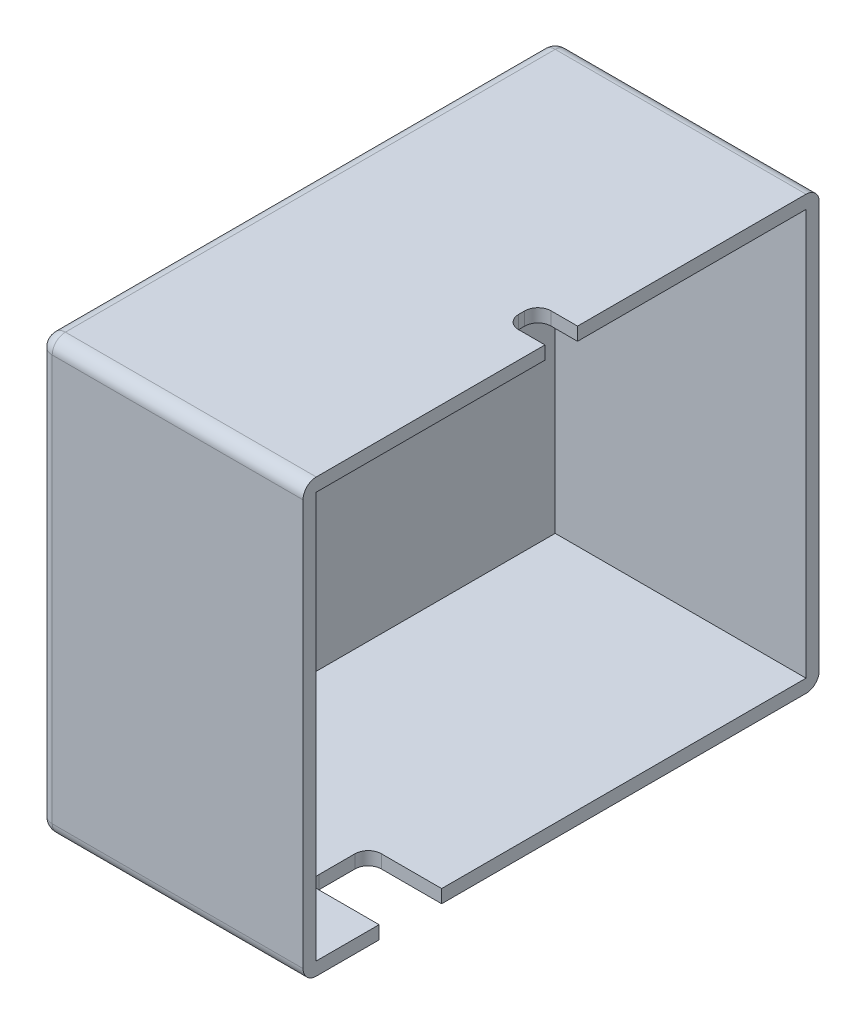
ISO-10303-21;
HEADER;
FILE_DESCRIPTION(('STEP AP214'),'2;1');
FILE_NAME('part.step','',(''),(''),'','','');
FILE_SCHEMA(('AUTOMOTIVE_DESIGN { 1 0 10303 214 1 1 1 1 }'));
ENDSEC;
DATA;
#1=APPLICATION_CONTEXT('core data for automotive mechanical design processes');
#2=APPLICATION_PROTOCOL_DEFINITION('international standard','automotive_design',2000,#1);
#3=PRODUCT_CONTEXT('',#1,'mechanical');
#4=PRODUCT('Part','Part','',(#3));
#5=PRODUCT_RELATED_PRODUCT_CATEGORY('part','',(#4));
#6=PRODUCT_DEFINITION_FORMATION('','',#4);
#7=PRODUCT_DEFINITION_CONTEXT('part definition',#1,'design');
#8=PRODUCT_DEFINITION('design','',#6,#7);
#9=PRODUCT_DEFINITION_SHAPE('','',#8);
#10=(LENGTH_UNIT() NAMED_UNIT(*) SI_UNIT(.MILLI.,.METRE.));
#11=(NAMED_UNIT(*) PLANE_ANGLE_UNIT() SI_UNIT($,.RADIAN.));
#12=(NAMED_UNIT(*) SI_UNIT($,.STERADIAN.) SOLID_ANGLE_UNIT());
#13=UNCERTAINTY_MEASURE_WITH_UNIT(LENGTH_MEASURE(1.E-05),#10,'distance_accuracy_value','');
#14=(GEOMETRIC_REPRESENTATION_CONTEXT(3) GLOBAL_UNCERTAINTY_ASSIGNED_CONTEXT((#13)) GLOBAL_UNIT_ASSIGNED_CONTEXT((#10,
#11,#12)) REPRESENTATION_CONTEXT('',''));
#15=CARTESIAN_POINT('',(0.,0.,0.));
#16=DIRECTION('',(0.,0.,1.));
#17=DIRECTION('',(1.,0.,0.));
#18=AXIS2_PLACEMENT_3D('',#15,#16,#17);
#19=CARTESIAN_POINT('',(40.,0.,0.));
#20=DIRECTION('',(1.,0.,0.));
#21=DIRECTION('',(0.,0.,-1.));
#22=AXIS2_PLACEMENT_3D('',#19,#20,#21);
#23=PLANE('',#22);
#24=DIRECTION('',(0.,1.,0.));
#25=VECTOR('',#24,1.);
#26=CARTESIAN_POINT('',(40.,14.9474180466149,-21.8083011583012));
#27=LINE('',#26,#25);
#28=CARTESIAN_POINT('',(40.,22.7162162162162,-21.8083011583012));
#29=VERTEX_POINT('',#28);
#30=CARTESIAN_POINT('',(40.,24.7162162162162,-21.8083011583012));
#31=VERTEX_POINT('',#30);
#32=EDGE_CURVE('E229',#29,#31,#27,.T.);
#33=ORIENTED_EDGE('',*,*,#32,.T.);
#34=DIRECTION('',(0.,0.,1.));
#35=VECTOR('',#34,1.);
#36=CARTESIAN_POINT('',(40.,24.7162162162162,14.8416988416988));
#37=LINE('',#36,#35);
#38=CARTESIAN_POINT('',(40.,24.7162162162162,12.8416988416988));
#39=VERTEX_POINT('',#38);
#40=EDGE_CURVE('E247',#31,#39,#37,.T.);
#41=ORIENTED_EDGE('',*,*,#40,.T.);
#42=CARTESIAN_POINT('',(40.,22.7162162162162,12.8416988416988));
#43=DIRECTION('',(1.,0.,0.));
#44=DIRECTION('',(0.,0.,-1.));
#45=AXIS2_PLACEMENT_3D('',#42,#43,#44);
#46=CIRCLE('',#45,2.);
#47=CARTESIAN_POINT('',(40.,22.7162162162162,14.8416988416988));
#48=VERTEX_POINT('',#47);
#49=EDGE_CURVE('E266',#39,#48,#46,.T.);
#50=ORIENTED_EDGE('',*,*,#49,.T.);
#51=DIRECTION('',(0.,-1.,0.));
#52=VECTOR('',#51,1.);
#53=CARTESIAN_POINT('',(40.,24.7162162162162,14.8416988416988));
#54=LINE('',#53,#52);
#55=CARTESIAN_POINT('',(40.,-38.7837837837838,14.8416988416988));
#56=VERTEX_POINT('',#55);
#57=EDGE_CURVE('E332',#48,#56,#54,.T.);
#58=ORIENTED_EDGE('',*,*,#57,.T.);
#59=CARTESIAN_POINT('',(40.,-38.7837837837838,12.8416988416988));
#60=DIRECTION('',(1.,0.,0.));
#61=DIRECTION('',(0.,0.,-1.));
#62=AXIS2_PLACEMENT_3D('',#59,#60,#61);
#63=CIRCLE('',#62,2.);
#64=CARTESIAN_POINT('',(40.,-40.7837837837838,12.8416988416988));
#65=VERTEX_POINT('',#64);
#66=EDGE_CURVE('E271',#56,#65,#63,.T.);
#67=ORIENTED_EDGE('',*,*,#66,.T.);
#68=DIRECTION('',(0.,0.,-1.));
#69=VECTOR('',#68,1.);
#70=CARTESIAN_POINT('',(40.,-40.7837837837838,14.8416988416988));
#71=LINE('',#70,#69);
#72=CARTESIAN_POINT('',(40.,-40.7837837837838,3.31669884169884));
#73=VERTEX_POINT('',#72);
#74=EDGE_CURVE('E433',#65,#73,#71,.T.);
#75=ORIENTED_EDGE('',*,*,#74,.T.);
#76=DIRECTION('',(0.,-1.,0.));
#77=VECTOR('',#76,1.);
#78=CARTESIAN_POINT('',(40.,-16.1660465497337,3.31669884169884));
#79=LINE('',#78,#77);
#80=CARTESIAN_POINT('',(40.,-38.7837837837838,3.31669884169884));
#81=VERTEX_POINT('',#80);
#82=EDGE_CURVE('E397',#81,#73,#79,.T.);
#83=ORIENTED_EDGE('',*,*,#82,.F.);
#84=DIRECTION('',(0.,0.,-1.));
#85=VECTOR('',#84,1.);
#86=CARTESIAN_POINT('',(40.,-38.7837837837838,12.8416988416988));
#87=LINE('',#86,#85);
#88=CARTESIAN_POINT('',(40.,-38.7837837837838,12.8416988416988));
#89=VERTEX_POINT('',#88);
#90=EDGE_CURVE('E411',#89,#81,#87,.T.);
#91=ORIENTED_EDGE('',*,*,#90,.F.);
#92=DIRECTION('',(0.,-1.,0.));
#93=VECTOR('',#92,1.);
#94=CARTESIAN_POINT('',(40.,-38.7837837837838,12.8416988416988));
#95=LINE('',#94,#93);
#96=CARTESIAN_POINT('',(40.,22.7162162162162,12.8416988416988));
#97=VERTEX_POINT('',#96);
#98=EDGE_CURVE('E399',#97,#89,#95,.T.);
#99=ORIENTED_EDGE('',*,*,#98,.F.);
#100=DIRECTION('',(0.,0.,1.));
#101=VECTOR('',#100,1.);
#102=CARTESIAN_POINT('',(40.,22.7162162162162,12.8416988416988));
#103=LINE('',#102,#101);
#104=EDGE_CURVE('E417',#29,#97,#103,.T.);
#105=ORIENTED_EDGE('',*,*,#104,.F.);
#106=EDGE_LOOP('',(#33,#41,#50,#58,#67,#75,#83,#91,#99,#105));
#107=FACE_BOUND('',#106,.T.);
#108=ADVANCED_FACE('F45',(#107),#23,.T.);
#109=CARTESIAN_POINT('',(40.,24.7162162162162,14.8416988416988));
#110=DIRECTION('',(0.,0.,-1.));
#111=DIRECTION('',(0.,1.,0.));
#112=AXIS2_PLACEMENT_3D('',#109,#110,#111);
#113=PLANE('',#112);
#114=DIRECTION('',(0.,-1.,0.));
#115=VECTOR('',#114,1.);
#116=CARTESIAN_POINT('',(2.,24.7162162162162,14.8416988416988));
#117=LINE('',#116,#115);
#118=CARTESIAN_POINT('',(2.,22.7162162162162,14.8416988416988));
#119=VERTEX_POINT('',#118);
#120=CARTESIAN_POINT('',(2.,-38.7837837837838,14.8416988416988));
#121=VERTEX_POINT('',#120);
#122=EDGE_CURVE('E262',#119,#121,#117,.T.);
#123=ORIENTED_EDGE('',*,*,#122,.T.);
#124=DIRECTION('',(-1.,0.,0.));
#125=VECTOR('',#124,1.);
#126=CARTESIAN_POINT('',(40.,-38.7837837837838,14.8416988416988));
#127=LINE('',#126,#125);
#128=EDGE_CURVE('E264',#121,#56,#127,.F.);
#129=ORIENTED_EDGE('',*,*,#128,.T.);
#130=ORIENTED_EDGE('',*,*,#57,.F.);
#131=DIRECTION('',(-1.,0.,0.));
#132=VECTOR('',#131,1.);
#133=CARTESIAN_POINT('',(40.,22.7162162162162,14.8416988416988));
#134=LINE('',#133,#132);
#135=EDGE_CURVE('E260',#48,#119,#134,.T.);
#136=ORIENTED_EDGE('',*,*,#135,.T.);
#137=EDGE_LOOP('',(#123,#129,#130,#136));
#138=FACE_BOUND('',#137,.T.);
#139=ADVANCED_FACE('F488',(#138),#113,.F.);
#140=CARTESIAN_POINT('',(40.,-40.7837837837838,14.8416988416988));
#141=DIRECTION('',(0.,1.,0.));
#142=DIRECTION('',(0.,0.,1.));
#143=AXIS2_PLACEMENT_3D('',#140,#141,#142);
#144=PLANE('',#143);
#145=CARTESIAN_POINT('',(40.,-40.7837837837838,-6.15830115830116));
#146=VERTEX_POINT('',#145);
#147=CARTESIAN_POINT('',(40.,-40.7837837837838,-61.3583011583012));
#148=VERTEX_POINT('',#147);
#149=EDGE_CURVE('E432',#146,#148,#71,.T.);
#150=ORIENTED_EDGE('',*,*,#149,.F.);
#151=DIRECTION('',(1.,0.,0.));
#152=VECTOR('',#151,1.);
#153=CARTESIAN_POINT('',(28.8688447659852,-40.7837837837838,-6.15830115830116));
#154=LINE('',#153,#152);
#155=CARTESIAN_POINT('',(30.8688447659852,-40.7837837837838,-6.15830115830116));
#156=VERTEX_POINT('',#155);
#157=EDGE_CURVE('E393',#156,#146,#154,.T.);
#158=ORIENTED_EDGE('',*,*,#157,.F.);
#159=CARTESIAN_POINT('',(30.8688447659852,-40.7837837837838,-4.15830115830116));
#160=DIRECTION('',(0.,1.,0.));
#161=DIRECTION('',(0.,0.,1.));
#162=AXIS2_PLACEMENT_3D('',#159,#160,#161);
#163=CIRCLE('',#162,2.);
#164=CARTESIAN_POINT('',(28.8688447659852,-40.7837837837838,-4.15830115830116));
#165=VERTEX_POINT('',#164);
#166=EDGE_CURVE('E350',#156,#165,#163,.T.);
#167=ORIENTED_EDGE('',*,*,#166,.T.);
#168=DIRECTION('',(0.,0.,-1.));
#169=VECTOR('',#168,1.);
#170=CARTESIAN_POINT('',(28.8688447659852,-40.7837837837838,3.31669884169884));
#171=LINE('',#170,#169);
#172=CARTESIAN_POINT('',(28.8688447659852,-40.7837837837838,1.31669884169884));
#173=VERTEX_POINT('',#172);
#174=EDGE_CURVE('E383',#173,#165,#171,.T.);
#175=ORIENTED_EDGE('',*,*,#174,.F.);
#176=CARTESIAN_POINT('',(30.8688447659852,-40.7837837837838,1.31669884169884));
#177=DIRECTION('',(0.,1.,0.));
#178=DIRECTION('',(0.,0.,1.));
#179=AXIS2_PLACEMENT_3D('',#176,#177,#178);
#180=CIRCLE('',#179,2.);
#181=CARTESIAN_POINT('',(30.8688447659852,-40.7837837837838,3.31669884169884));
#182=VERTEX_POINT('',#181);
#183=EDGE_CURVE('E354',#173,#182,#180,.T.);
#184=ORIENTED_EDGE('',*,*,#183,.T.);
#185=DIRECTION('',(-1.,0.,0.));
#186=VECTOR('',#185,1.);
#187=CARTESIAN_POINT('',(28.8688447659852,-40.7837837837838,3.31669884169884));
#188=LINE('',#187,#186);
#189=EDGE_CURVE('E389',#73,#182,#188,.T.);
#190=ORIENTED_EDGE('',*,*,#189,.F.);
#191=ORIENTED_EDGE('',*,*,#74,.F.);
#192=DIRECTION('',(-1.,0.,0.));
#193=VECTOR('',#192,1.);
#194=CARTESIAN_POINT('',(40.,-40.7837837837838,12.8416988416988));
#195=LINE('',#194,#193);
#196=CARTESIAN_POINT('',(2.,-40.7837837837838,12.8416988416988));
#197=VERTEX_POINT('',#196);
#198=EDGE_CURVE('E257',#65,#197,#195,.T.);
#199=ORIENTED_EDGE('',*,*,#198,.T.);
#200=DIRECTION('',(0.,0.,-1.));
#201=VECTOR('',#200,1.);
#202=CARTESIAN_POINT('',(2.,-40.7837837837838,14.8416988416988));
#203=LINE('',#202,#201);
#204=CARTESIAN_POINT('',(2.,-40.7837837837838,-61.3583011583012));
#205=VERTEX_POINT('',#204);
#206=EDGE_CURVE('E246',#197,#205,#203,.T.);
#207=ORIENTED_EDGE('',*,*,#206,.T.);
#208=DIRECTION('',(-1.,0.,0.));
#209=VECTOR('',#208,1.);
#210=CARTESIAN_POINT('',(40.,-40.7837837837838,-61.3583011583012));
#211=LINE('',#210,#209);
#212=EDGE_CURVE('E249',#205,#148,#211,.F.);
#213=ORIENTED_EDGE('',*,*,#212,.T.);
#214=EDGE_LOOP('',(#150,#158,#167,#175,#184,#190,#191,#199,#207,#213));
#215=FACE_BOUND('',#214,.T.);
#216=ADVANCED_FACE('F446',(#215),#144,.F.);
#217=CARTESIAN_POINT('',(40.,24.7162162162162,-63.3583011583012));
#218=DIRECTION('',(0.,0.,1.));
#219=DIRECTION('',(0.,-1.,0.));
#220=AXIS2_PLACEMENT_3D('',#217,#218,#219);
#221=PLANE('',#220);
#222=DIRECTION('',(0.,1.,0.));
#223=VECTOR('',#222,1.);
#224=CARTESIAN_POINT('',(40.,24.7162162162162,-63.3583011583012));
#225=LINE('',#224,#223);
#226=CARTESIAN_POINT('',(40.,-38.7837837837838,-63.3583011583012));
#227=VERTEX_POINT('',#226);
#228=CARTESIAN_POINT('',(40.,22.7162162162162,-63.3583011583012));
#229=VERTEX_POINT('',#228);
#230=EDGE_CURVE('E251',#227,#229,#225,.T.);
#231=ORIENTED_EDGE('',*,*,#230,.F.);
#232=DIRECTION('',(-1.,0.,0.));
#233=VECTOR('',#232,1.);
#234=CARTESIAN_POINT('',(40.,-38.7837837837838,-63.3583011583012));
#235=LINE('',#234,#233);
#236=CARTESIAN_POINT('',(2.,-38.7837837837838,-63.3583011583012));
#237=VERTEX_POINT('',#236);
#238=EDGE_CURVE('E277',#227,#237,#235,.T.);
#239=ORIENTED_EDGE('',*,*,#238,.T.);
#240=DIRECTION('',(0.,1.,0.));
#241=VECTOR('',#240,1.);
#242=CARTESIAN_POINT('',(2.,24.7162162162162,-63.3583011583012));
#243=LINE('',#242,#241);
#244=CARTESIAN_POINT('',(2.,22.7162162162162,-63.3583011583012));
#245=VERTEX_POINT('',#244);
#246=EDGE_CURVE('E273',#237,#245,#243,.T.);
#247=ORIENTED_EDGE('',*,*,#246,.T.);
#248=DIRECTION('',(-1.,0.,0.));
#249=VECTOR('',#248,1.);
#250=CARTESIAN_POINT('',(40.,22.7162162162162,-63.3583011583012));
#251=LINE('',#250,#249);
#252=EDGE_CURVE('E275',#245,#229,#251,.F.);
#253=ORIENTED_EDGE('',*,*,#252,.T.);
#254=EDGE_LOOP('',(#231,#239,#247,#253));
#255=FACE_BOUND('',#254,.T.);
#256=ADVANCED_FACE('F454',(#255),#221,.F.);
#257=CARTESIAN_POINT('',(40.,24.7162162162162,14.8416988416988));
#258=DIRECTION('',(0.,-1.,0.));
#259=DIRECTION('',(0.,0.,-1.));
#260=AXIS2_PLACEMENT_3D('',#257,#258,#259);
#261=PLANE('',#260);
#262=ORIENTED_EDGE('',*,*,#40,.F.);
#263=DIRECTION('',(1.,0.,0.));
#264=VECTOR('',#263,1.);
#265=CARTESIAN_POINT('',(40.,24.7162162162162,-21.8083011583012));
#266=LINE('',#265,#264);
#267=CARTESIAN_POINT('',(36.,24.7162162162162,-21.8083011583012));
#268=VERTEX_POINT('',#267);
#269=EDGE_CURVE('E230',#268,#31,#266,.T.);
#270=ORIENTED_EDGE('',*,*,#269,.F.);
#271=CARTESIAN_POINT('',(36.,24.7162162162162,-23.8083011583012));
#272=DIRECTION('',(0.,-1.,0.));
#273=DIRECTION('',(0.,0.,-1.));
#274=AXIS2_PLACEMENT_3D('',#271,#272,#273);
#275=CIRCLE('',#274,2.);
#276=CARTESIAN_POINT('',(34.,24.7162162162162,-23.8083011583012));
#277=VERTEX_POINT('',#276);
#278=EDGE_CURVE('E53',#268,#277,#275,.T.);
#279=ORIENTED_EDGE('',*,*,#278,.T.);
#280=DIRECTION('',(0.,0.,1.));
#281=VECTOR('',#280,1.);
#282=CARTESIAN_POINT('',(34.,24.7162162162162,-26.7433011583012));
#283=LINE('',#282,#281);
#284=CARTESIAN_POINT('',(34.,24.7162162162162,-24.7433011583012));
#285=VERTEX_POINT('',#284);
#286=EDGE_CURVE('E240',#285,#277,#283,.T.);
#287=ORIENTED_EDGE('',*,*,#286,.F.);
#288=CARTESIAN_POINT('',(36.,24.7162162162162,-24.7433011583012));
#289=DIRECTION('',(0.,-1.,0.));
#290=DIRECTION('',(0.,0.,-1.));
#291=AXIS2_PLACEMENT_3D('',#288,#289,#290);
#292=CIRCLE('',#291,2.);
#293=CARTESIAN_POINT('',(36.,24.7162162162162,-26.7433011583012));
#294=VERTEX_POINT('',#293);
#295=EDGE_CURVE('E239',#285,#294,#292,.T.);
#296=ORIENTED_EDGE('',*,*,#295,.T.);
#297=DIRECTION('',(-1.,0.,0.));
#298=VECTOR('',#297,1.);
#299=CARTESIAN_POINT('',(40.,24.7162162162162,-26.7433011583012));
#300=LINE('',#299,#298);
#301=CARTESIAN_POINT('',(40.,24.7162162162162,-26.7433011583012));
#302=VERTEX_POINT('',#301);
#303=EDGE_CURVE('E221',#302,#294,#300,.T.);
#304=ORIENTED_EDGE('',*,*,#303,.F.);
#305=CARTESIAN_POINT('',(40.,24.7162162162162,-61.3583011583012));
#306=VERTEX_POINT('',#305);
#307=EDGE_CURVE('E236',#306,#302,#37,.T.);
#308=ORIENTED_EDGE('',*,*,#307,.F.);
#309=DIRECTION('',(-1.,0.,0.));
#310=VECTOR('',#309,1.);
#311=CARTESIAN_POINT('',(40.,24.7162162162162,-61.3583011583012));
#312=LINE('',#311,#310);
#313=CARTESIAN_POINT('',(2.,24.7162162162162,-61.3583011583012));
#314=VERTEX_POINT('',#313);
#315=EDGE_CURVE('E284',#306,#314,#312,.T.);
#316=ORIENTED_EDGE('',*,*,#315,.T.);
#317=DIRECTION('',(0.,0.,1.));
#318=VECTOR('',#317,1.);
#319=CARTESIAN_POINT('',(2.,24.7162162162162,14.8416988416988));
#320=LINE('',#319,#318);
#321=CARTESIAN_POINT('',(2.,24.7162162162162,12.8416988416988));
#322=VERTEX_POINT('',#321);
#323=EDGE_CURVE('E282',#314,#322,#320,.T.);
#324=ORIENTED_EDGE('',*,*,#323,.T.);
#325=DIRECTION('',(-1.,0.,0.));
#326=VECTOR('',#325,1.);
#327=CARTESIAN_POINT('',(40.,24.7162162162162,12.8416988416988));
#328=LINE('',#327,#326);
#329=EDGE_CURVE('E279',#322,#39,#328,.F.);
#330=ORIENTED_EDGE('',*,*,#329,.T.);
#331=EDGE_LOOP('',(#262,#270,#279,#287,#296,#304,#308,#316,#324,#330));
#332=FACE_BOUND('',#331,.T.);
#333=ADVANCED_FACE('F235',(#332),#261,.F.);
#334=DIRECTION('',(0.,1.,0.));
#335=VECTOR('',#334,1.);
#336=CARTESIAN_POINT('',(40.,14.9474180466149,-26.7433011583012));
#337=LINE('',#336,#335);
#338=CARTESIAN_POINT('',(40.,22.7162162162162,-26.7433011583012));
#339=VERTEX_POINT('',#338);
#340=EDGE_CURVE('E218',#339,#302,#337,.T.);
#341=ORIENTED_EDGE('',*,*,#340,.F.);
#342=CARTESIAN_POINT('',(40.,22.7162162162162,-61.3583011583012));
#343=VERTEX_POINT('',#342);
#344=EDGE_CURVE('E418',#343,#339,#103,.T.);
#345=ORIENTED_EDGE('',*,*,#344,.F.);
#346=DIRECTION('',(0.,1.,0.));
#347=VECTOR('',#346,1.);
#348=CARTESIAN_POINT('',(40.,-38.7837837837838,-61.3583011583012));
#349=LINE('',#348,#347);
#350=CARTESIAN_POINT('',(40.,-38.7837837837838,-61.3583011583012));
#351=VERTEX_POINT('',#350);
#352=EDGE_CURVE('E414',#351,#343,#349,.T.);
#353=ORIENTED_EDGE('',*,*,#352,.F.);
#354=CARTESIAN_POINT('',(40.,-38.7837837837838,-6.15830115830116));
#355=VERTEX_POINT('',#354);
#356=EDGE_CURVE('E410',#355,#351,#87,.T.);
#357=ORIENTED_EDGE('',*,*,#356,.F.);
#358=DIRECTION('',(0.,-1.,0.));
#359=VECTOR('',#358,1.);
#360=CARTESIAN_POINT('',(40.,-16.1660465497337,-6.15830115830116));
#361=LINE('',#360,#359);
#362=EDGE_CURVE('E392',#355,#146,#361,.T.);
#363=ORIENTED_EDGE('',*,*,#362,.T.);
#364=ORIENTED_EDGE('',*,*,#149,.T.);
#365=CARTESIAN_POINT('',(40.,-38.7837837837838,-61.3583011583012));
#366=DIRECTION('',(1.,0.,0.));
#367=DIRECTION('',(0.,0.,-1.));
#368=AXIS2_PLACEMENT_3D('',#365,#366,#367);
#369=CIRCLE('',#368,2.);
#370=EDGE_CURVE('E269',#148,#227,#369,.T.);
#371=ORIENTED_EDGE('',*,*,#370,.T.);
#372=ORIENTED_EDGE('',*,*,#230,.T.);
#373=CARTESIAN_POINT('',(40.,22.7162162162162,-61.3583011583012));
#374=DIRECTION('',(1.,0.,0.));
#375=DIRECTION('',(0.,0.,-1.));
#376=AXIS2_PLACEMENT_3D('',#373,#374,#375);
#377=CIRCLE('',#376,2.);
#378=EDGE_CURVE('E245',#229,#306,#377,.T.);
#379=ORIENTED_EDGE('',*,*,#378,.T.);
#380=ORIENTED_EDGE('',*,*,#307,.T.);
#381=EDGE_LOOP('',(#341,#345,#353,#357,#363,#364,#371,#372,#379,#380));
#382=FACE_BOUND('',#381,.T.);
#383=ADVANCED_FACE('F242',(#382),#23,.T.);
#384=CARTESIAN_POINT('',(0.,0.,0.));
#385=DIRECTION('',(1.,0.,0.));
#386=DIRECTION('',(0.,0.,-1.));
#387=AXIS2_PLACEMENT_3D('',#384,#385,#386);
#388=PLANE('',#387);
#389=DIRECTION('',(0.,1.,0.));
#390=VECTOR('',#389,1.);
#391=CARTESIAN_POINT('',(0.,0.,-61.3583011583012));
#392=LINE('',#391,#390);
#393=CARTESIAN_POINT('',(0.,22.7162162162162,-61.3583011583012));
#394=VERTEX_POINT('',#393);
#395=CARTESIAN_POINT('',(0.,-38.7837837837838,-61.3583011583012));
#396=VERTEX_POINT('',#395);
#397=EDGE_CURVE('E290',#394,#396,#392,.F.);
#398=ORIENTED_EDGE('',*,*,#397,.T.);
#399=DIRECTION('',(0.,0.,-1.));
#400=VECTOR('',#399,1.);
#401=CARTESIAN_POINT('',(0.,-38.7837837837838,0.));
#402=LINE('',#401,#400);
#403=CARTESIAN_POINT('',(0.,-38.7837837837838,12.8416988416988));
#404=VERTEX_POINT('',#403);
#405=EDGE_CURVE('E293',#396,#404,#402,.F.);
#406=ORIENTED_EDGE('',*,*,#405,.T.);
#407=DIRECTION('',(0.,-1.,0.));
#408=VECTOR('',#407,1.);
#409=CARTESIAN_POINT('',(0.,0.,12.8416988416988));
#410=LINE('',#409,#408);
#411=CARTESIAN_POINT('',(0.,22.7162162162162,12.8416988416988));
#412=VERTEX_POINT('',#411);
#413=EDGE_CURVE('E288',#404,#412,#410,.F.);
#414=ORIENTED_EDGE('',*,*,#413,.T.);
#415=DIRECTION('',(0.,0.,1.));
#416=VECTOR('',#415,1.);
#417=CARTESIAN_POINT('',(0.,22.7162162162162,0.));
#418=LINE('',#417,#416);
#419=EDGE_CURVE('E286',#412,#394,#418,.F.);
#420=ORIENTED_EDGE('',*,*,#419,.T.);
#421=EDGE_LOOP('',(#398,#406,#414,#420));
#422=FACE_BOUND('',#421,.T.);
#423=ADVANCED_FACE('F555',(#422),#388,.F.);
#424=CARTESIAN_POINT('',(40.,22.7162162162162,-61.3583011583012));
#425=DIRECTION('',(-1.,0.,0.));
#426=DIRECTION('',(0.,0.,1.));
#427=AXIS2_PLACEMENT_3D('',#424,#425,#426);
#428=CYLINDRICAL_SURFACE('',#427,2.);
#429=CARTESIAN_POINT('',(2.,22.7162162162162,-61.3583011583012));
#430=DIRECTION('',(-1.,0.,0.));
#431=DIRECTION('',(0.,0.,1.));
#432=AXIS2_PLACEMENT_3D('',#429,#430,#431);
#433=CIRCLE('',#432,2.);
#434=EDGE_CURVE('E329',#314,#245,#433,.T.);
#435=ORIENTED_EDGE('',*,*,#434,.F.);
#436=ORIENTED_EDGE('',*,*,#315,.F.);
#437=ORIENTED_EDGE('',*,*,#378,.F.);
#438=ORIENTED_EDGE('',*,*,#252,.F.);
#439=EDGE_LOOP('',(#435,#436,#437,#438));
#440=FACE_BOUND('',#439,.T.);
#441=ADVANCED_FACE('F467',(#440),#428,.T.);
#442=CARTESIAN_POINT('',(2.,22.7162162162162,-61.3583011583012));
#443=DIRECTION('',(0.,0.,-1.));
#444=DIRECTION('',(-1.,0.,0.));
#445=AXIS2_PLACEMENT_3D('',#442,#443,#444);
#446=SPHERICAL_SURFACE('',#445,2.);
#447=CARTESIAN_POINT('',(2.,22.7162162162162,-61.3583011583012));
#448=DIRECTION('',(0.,0.,-1.));
#449=DIRECTION('',(0.,1.,0.));
#450=AXIS2_PLACEMENT_3D('',#447,#448,#449);
#451=CIRCLE('',#450,2.);
#452=EDGE_CURVE('E323',#314,#394,#451,.F.);
#453=ORIENTED_EDGE('',*,*,#452,.F.);
#454=ORIENTED_EDGE('',*,*,#434,.T.);
#455=CARTESIAN_POINT('',(2.,22.7162162162162,-61.3583011583012));
#456=DIRECTION('',(0.,1.,0.));
#457=DIRECTION('',(0.,0.,1.));
#458=AXIS2_PLACEMENT_3D('',#455,#456,#457);
#459=CIRCLE('',#458,2.);
#460=EDGE_CURVE('E326',#394,#245,#459,.F.);
#461=ORIENTED_EDGE('',*,*,#460,.F.);
#462=EDGE_LOOP('',(#453,#454,#461));
#463=FACE_BOUND('',#462,.T.);
#464=ADVANCED_FACE('F463',(#463),#446,.T.);
#465=CARTESIAN_POINT('',(40.,-38.7837837837838,-61.3583011583012));
#466=DIRECTION('',(-1.,0.,0.));
#467=DIRECTION('',(0.,0.,1.));
#468=AXIS2_PLACEMENT_3D('',#465,#466,#467);
#469=CYLINDRICAL_SURFACE('',#468,2.);
#470=ORIENTED_EDGE('',*,*,#370,.F.);
#471=ORIENTED_EDGE('',*,*,#212,.F.);
#472=CARTESIAN_POINT('',(2.,-38.7837837837838,-61.3583011583012));
#473=DIRECTION('',(-1.,0.,0.));
#474=DIRECTION('',(0.,0.,1.));
#475=AXIS2_PLACEMENT_3D('',#472,#473,#474);
#476=CIRCLE('',#475,2.);
#477=EDGE_CURVE('E320',#237,#205,#476,.T.);
#478=ORIENTED_EDGE('',*,*,#477,.F.);
#479=ORIENTED_EDGE('',*,*,#238,.F.);
#480=EDGE_LOOP('',(#470,#471,#478,#479));
#481=FACE_BOUND('',#480,.T.);
#482=ADVANCED_FACE('F451',(#481),#469,.T.);
#483=CARTESIAN_POINT('',(2.,24.7162162162162,-61.3583011583012));
#484=DIRECTION('',(0.,1.,0.));
#485=DIRECTION('',(0.,0.,1.));
#486=AXIS2_PLACEMENT_3D('',#483,#484,#485);
#487=CYLINDRICAL_SURFACE('',#486,2.);
#488=ORIENTED_EDGE('',*,*,#460,.T.);
#489=ORIENTED_EDGE('',*,*,#246,.F.);
#490=CARTESIAN_POINT('',(2.,-38.7837837837838,-61.3583011583012));
#491=DIRECTION('',(0.,-1.,0.));
#492=DIRECTION('',(0.,0.,-1.));
#493=AXIS2_PLACEMENT_3D('',#490,#491,#492);
#494=CIRCLE('',#493,2.);
#495=EDGE_CURVE('E317',#396,#237,#494,.T.);
#496=ORIENTED_EDGE('',*,*,#495,.F.);
#497=ORIENTED_EDGE('',*,*,#397,.F.);
#498=EDGE_LOOP('',(#488,#489,#496,#497));
#499=FACE_BOUND('',#498,.T.);
#500=ADVANCED_FACE('F458',(#499),#487,.T.);
#501=CARTESIAN_POINT('',(2.,22.7162162162162,14.8416988416988));
#502=DIRECTION('',(0.,0.,1.));
#503=DIRECTION('',(1.,0.,0.));
#504=AXIS2_PLACEMENT_3D('',#501,#502,#503);
#505=CYLINDRICAL_SURFACE('',#504,2.);
#506=ORIENTED_EDGE('',*,*,#452,.T.);
#507=ORIENTED_EDGE('',*,*,#419,.F.);
#508=CARTESIAN_POINT('',(2.,22.7162162162162,12.8416988416988));
#509=DIRECTION('',(0.,0.,1.));
#510=DIRECTION('',(1.,0.,0.));
#511=AXIS2_PLACEMENT_3D('',#508,#509,#510);
#512=CIRCLE('',#511,2.);
#513=EDGE_CURVE('E314',#322,#412,#512,.T.);
#514=ORIENTED_EDGE('',*,*,#513,.F.);
#515=ORIENTED_EDGE('',*,*,#323,.F.);
#516=EDGE_LOOP('',(#506,#507,#514,#515));
#517=FACE_BOUND('',#516,.T.);
#518=ADVANCED_FACE('F478',(#517),#505,.T.);
#519=CARTESIAN_POINT('',(40.,22.7162162162162,12.8416988416988));
#520=DIRECTION('',(-1.,0.,0.));
#521=DIRECTION('',(0.,0.,1.));
#522=AXIS2_PLACEMENT_3D('',#519,#520,#521);
#523=CYLINDRICAL_SURFACE('',#522,2.);
#524=ORIENTED_EDGE('',*,*,#49,.F.);
#525=ORIENTED_EDGE('',*,*,#329,.F.);
#526=CARTESIAN_POINT('',(2.,22.7162162162162,12.8416988416988));
#527=DIRECTION('',(-1.,0.,0.));
#528=DIRECTION('',(0.,0.,1.));
#529=AXIS2_PLACEMENT_3D('',#526,#527,#528);
#530=CIRCLE('',#529,2.);
#531=EDGE_CURVE('E311',#119,#322,#530,.T.);
#532=ORIENTED_EDGE('',*,*,#531,.F.);
#533=ORIENTED_EDGE('',*,*,#135,.F.);
#534=EDGE_LOOP('',(#524,#525,#532,#533));
#535=FACE_BOUND('',#534,.T.);
#536=ADVANCED_FACE('F474',(#535),#523,.T.);
#537=CARTESIAN_POINT('',(2.,-38.7837837837838,-61.3583011583012));
#538=DIRECTION('',(0.,0.,-1.));
#539=DIRECTION('',(-1.,0.,0.));
#540=AXIS2_PLACEMENT_3D('',#537,#538,#539);
#541=SPHERICAL_SURFACE('',#540,2.);
#542=ORIENTED_EDGE('',*,*,#495,.T.);
#543=ORIENTED_EDGE('',*,*,#477,.T.);
#544=CARTESIAN_POINT('',(2.,-38.7837837837838,-61.3583011583012));
#545=DIRECTION('',(0.,0.,-1.));
#546=DIRECTION('',(-1.,0.,0.));
#547=AXIS2_PLACEMENT_3D('',#544,#545,#546);
#548=CIRCLE('',#547,2.);
#549=EDGE_CURVE('E308',#396,#205,#548,.F.);
#550=ORIENTED_EDGE('',*,*,#549,.F.);
#551=EDGE_LOOP('',(#542,#543,#550));
#552=FACE_BOUND('',#551,.T.);
#553=ADVANCED_FACE('F584',(#552),#541,.T.);
#554=CARTESIAN_POINT('',(2.,22.7162162162162,12.8416988416988));
#555=DIRECTION('',(0.,1.,0.));
#556=DIRECTION('',(-1.,0.,0.));
#557=AXIS2_PLACEMENT_3D('',#554,#555,#556);
#558=SPHERICAL_SURFACE('',#557,2.);
#559=ORIENTED_EDGE('',*,*,#531,.T.);
#560=ORIENTED_EDGE('',*,*,#513,.T.);
#561=CARTESIAN_POINT('',(2.,22.7162162162162,12.8416988416988));
#562=DIRECTION('',(0.,1.,0.));
#563=DIRECTION('',(0.,0.,1.));
#564=AXIS2_PLACEMENT_3D('',#561,#562,#563);
#565=CIRCLE('',#564,2.);
#566=EDGE_CURVE('E305',#119,#412,#565,.F.);
#567=ORIENTED_EDGE('',*,*,#566,.F.);
#568=EDGE_LOOP('',(#559,#560,#567));
#569=FACE_BOUND('',#568,.T.);
#570=ADVANCED_FACE('F480',(#569),#558,.T.);
#571=CARTESIAN_POINT('',(2.,-38.7837837837838,14.8416988416988));
#572=DIRECTION('',(0.,0.,-1.));
#573=DIRECTION('',(-1.,0.,0.));
#574=AXIS2_PLACEMENT_3D('',#571,#572,#573);
#575=CYLINDRICAL_SURFACE('',#574,2.);
#576=ORIENTED_EDGE('',*,*,#549,.T.);
#577=ORIENTED_EDGE('',*,*,#206,.F.);
#578=CARTESIAN_POINT('',(2.,-38.7837837837838,12.8416988416988));
#579=DIRECTION('',(0.,0.,1.));
#580=DIRECTION('',(1.,0.,0.));
#581=AXIS2_PLACEMENT_3D('',#578,#579,#580);
#582=CIRCLE('',#581,2.);
#583=EDGE_CURVE('E302',#404,#197,#582,.T.);
#584=ORIENTED_EDGE('',*,*,#583,.F.);
#585=ORIENTED_EDGE('',*,*,#405,.F.);
#586=EDGE_LOOP('',(#576,#577,#584,#585));
#587=FACE_BOUND('',#586,.T.);
#588=ADVANCED_FACE('F578',(#587),#575,.T.);
#589=CARTESIAN_POINT('',(2.,24.7162162162162,12.8416988416988));
#590=DIRECTION('',(0.,-1.,0.));
#591=DIRECTION('',(0.,0.,-1.));
#592=AXIS2_PLACEMENT_3D('',#589,#590,#591);
#593=CYLINDRICAL_SURFACE('',#592,2.);
#594=ORIENTED_EDGE('',*,*,#566,.T.);
#595=ORIENTED_EDGE('',*,*,#413,.F.);
#596=CARTESIAN_POINT('',(2.,-38.7837837837838,12.8416988416988));
#597=DIRECTION('',(0.,-1.,0.));
#598=DIRECTION('',(0.,0.,-1.));
#599=AXIS2_PLACEMENT_3D('',#596,#597,#598);
#600=CIRCLE('',#599,2.);
#601=EDGE_CURVE('E298',#121,#404,#600,.T.);
#602=ORIENTED_EDGE('',*,*,#601,.F.);
#603=ORIENTED_EDGE('',*,*,#122,.F.);
#604=EDGE_LOOP('',(#594,#595,#602,#603));
#605=FACE_BOUND('',#604,.T.);
#606=ADVANCED_FACE('F485',(#605),#593,.T.);
#607=CARTESIAN_POINT('',(2.,-38.7837837837838,12.8416988416988));
#608=DIRECTION('',(-1.,0.,0.));
#609=DIRECTION('',(0.,0.,1.));
#610=AXIS2_PLACEMENT_3D('',#607,#608,#609);
#611=SPHERICAL_SURFACE('',#610,2.);
#612=ORIENTED_EDGE('',*,*,#601,.T.);
#613=ORIENTED_EDGE('',*,*,#583,.T.);
#614=CARTESIAN_POINT('',(2.,-38.7837837837838,12.8416988416988));
#615=DIRECTION('',(-1.,0.,0.));
#616=DIRECTION('',(0.,0.,1.));
#617=AXIS2_PLACEMENT_3D('',#614,#615,#616);
#618=CIRCLE('',#617,2.);
#619=EDGE_CURVE('E296',#121,#197,#618,.F.);
#620=ORIENTED_EDGE('',*,*,#619,.F.);
#621=EDGE_LOOP('',(#612,#613,#620));
#622=FACE_BOUND('',#621,.T.);
#623=ADVANCED_FACE('F572',(#622),#611,.T.);
#624=CARTESIAN_POINT('',(40.,-38.7837837837838,12.8416988416988));
#625=DIRECTION('',(-1.,0.,0.));
#626=DIRECTION('',(0.,0.,1.));
#627=AXIS2_PLACEMENT_3D('',#624,#625,#626);
#628=CYLINDRICAL_SURFACE('',#627,2.);
#629=ORIENTED_EDGE('',*,*,#66,.F.);
#630=ORIENTED_EDGE('',*,*,#128,.F.);
#631=ORIENTED_EDGE('',*,*,#619,.T.);
#632=ORIENTED_EDGE('',*,*,#198,.F.);
#633=EDGE_LOOP('',(#629,#630,#631,#632));
#634=FACE_BOUND('',#633,.T.);
#635=ADVANCED_FACE('F493',(#634),#628,.T.);
#636=CARTESIAN_POINT('',(-96.3736997318252,-38.7837837837838,12.8416988416988));
#637=DIRECTION('',(0.,0.,1.));
#638=DIRECTION('',(0.,-1.,0.));
#639=AXIS2_PLACEMENT_3D('',#636,#637,#638);
#640=PLANE('',#639);
#641=DIRECTION('',(0.,1.,0.));
#642=VECTOR('',#641,1.);
#643=CARTESIAN_POINT('',(2.,-38.7837837837838,12.8416988416988));
#644=LINE('',#643,#642);
#645=CARTESIAN_POINT('',(2.,-38.7837837837838,12.8416988416988));
#646=VERTEX_POINT('',#645);
#647=CARTESIAN_POINT('',(2.,22.7162162162162,12.8416988416988));
#648=VERTEX_POINT('',#647);
#649=EDGE_CURVE('E407',#646,#648,#644,.T.);
#650=ORIENTED_EDGE('',*,*,#649,.T.);
#651=DIRECTION('',(1.,0.,0.));
#652=VECTOR('',#651,1.);
#653=CARTESIAN_POINT('',(-96.3736997318252,22.7162162162162,12.8416988416988));
#654=LINE('',#653,#652);
#655=EDGE_CURVE('E405',#648,#97,#654,.T.);
#656=ORIENTED_EDGE('',*,*,#655,.T.);
#657=ORIENTED_EDGE('',*,*,#98,.T.);
#658=DIRECTION('',(1.,0.,0.));
#659=VECTOR('',#658,1.);
#660=CARTESIAN_POINT('',(-96.3736997318252,-38.7837837837838,12.8416988416988));
#661=LINE('',#660,#659);
#662=EDGE_CURVE('E420',#646,#89,#661,.T.);
#663=ORIENTED_EDGE('',*,*,#662,.F.);
#664=EDGE_LOOP('',(#650,#656,#657,#663));
#665=FACE_BOUND('',#664,.T.);
#666=ADVANCED_FACE('F533',(#665),#640,.F.);
#667=CARTESIAN_POINT('',(-96.3736997318252,22.7162162162162,12.8416988416988));
#668=DIRECTION('',(0.,1.,0.));
#669=DIRECTION('',(0.,0.,1.));
#670=AXIS2_PLACEMENT_3D('',#667,#668,#669);
#671=PLANE('',#670);
#672=DIRECTION('',(0.,0.,-1.));
#673=VECTOR('',#672,1.);
#674=CARTESIAN_POINT('',(34.,22.7162162162162,-26.7433011583012));
#675=LINE('',#674,#673);
#676=CARTESIAN_POINT('',(34.,22.7162162162162,-23.8083011583012));
#677=VERTEX_POINT('',#676);
#678=CARTESIAN_POINT('',(34.,22.7162162162162,-24.7433011583012));
#679=VERTEX_POINT('',#678);
#680=EDGE_CURVE('E381',#677,#679,#675,.T.);
#681=ORIENTED_EDGE('',*,*,#680,.F.);
#682=CARTESIAN_POINT('',(36.,22.7162162162162,-23.8083011583012));
#683=DIRECTION('',(0.,1.,0.));
#684=DIRECTION('',(0.,0.,1.));
#685=AXIS2_PLACEMENT_3D('',#682,#683,#684);
#686=CIRCLE('',#685,2.);
#687=CARTESIAN_POINT('',(36.,22.7162162162162,-21.8083011583012));
#688=VERTEX_POINT('',#687);
#689=EDGE_CURVE('E12',#677,#688,#686,.T.);
#690=ORIENTED_EDGE('',*,*,#689,.T.);
#691=DIRECTION('',(-1.,0.,0.));
#692=VECTOR('',#691,1.);
#693=CARTESIAN_POINT('',(40.,22.7162162162162,-21.8083011583012));
#694=LINE('',#693,#692);
#695=EDGE_CURVE('E379',#29,#688,#694,.T.);
#696=ORIENTED_EDGE('',*,*,#695,.F.);
#697=ORIENTED_EDGE('',*,*,#104,.T.);
#698=ORIENTED_EDGE('',*,*,#655,.F.);
#699=DIRECTION('',(0.,0.,-1.));
#700=VECTOR('',#699,1.);
#701=CARTESIAN_POINT('',(2.,22.7162162162162,12.8416988416988));
#702=LINE('',#701,#700);
#703=CARTESIAN_POINT('',(2.,22.7162162162162,-61.3583011583012));
#704=VERTEX_POINT('',#703);
#705=EDGE_CURVE('E404',#648,#704,#702,.T.);
#706=ORIENTED_EDGE('',*,*,#705,.T.);
#707=DIRECTION('',(1.,0.,0.));
#708=VECTOR('',#707,1.);
#709=CARTESIAN_POINT('',(-96.3736997318252,22.7162162162162,-61.3583011583012));
#710=LINE('',#709,#708);
#711=EDGE_CURVE('E423',#704,#343,#710,.T.);
#712=ORIENTED_EDGE('',*,*,#711,.T.);
#713=ORIENTED_EDGE('',*,*,#344,.T.);
#714=DIRECTION('',(1.,0.,0.));
#715=VECTOR('',#714,1.);
#716=CARTESIAN_POINT('',(40.,22.7162162162162,-26.7433011583012));
#717=LINE('',#716,#715);
#718=CARTESIAN_POINT('',(36.,22.7162162162162,-26.7433011583012));
#719=VERTEX_POINT('',#718);
#720=EDGE_CURVE('E224',#719,#339,#717,.T.);
#721=ORIENTED_EDGE('',*,*,#720,.F.);
#722=CARTESIAN_POINT('',(36.,22.7162162162162,-24.7433011583012));
#723=DIRECTION('',(0.,1.,0.));
#724=DIRECTION('',(0.,0.,1.));
#725=AXIS2_PLACEMENT_3D('',#722,#723,#724);
#726=CIRCLE('',#725,2.);
#727=EDGE_CURVE('E368',#719,#679,#726,.T.);
#728=ORIENTED_EDGE('',*,*,#727,.T.);
#729=EDGE_LOOP('',(#681,#690,#696,#697,#698,#706,#712,#713,#721,#728));
#730=FACE_BOUND('',#729,.T.);
#731=ADVANCED_FACE('F534',(#730),#671,.F.);
#732=CARTESIAN_POINT('',(-96.3736997318252,-38.7837837837838,-61.3583011583012));
#733=DIRECTION('',(0.,0.,-1.));
#734=DIRECTION('',(0.,1.,0.));
#735=AXIS2_PLACEMENT_3D('',#732,#733,#734);
#736=PLANE('',#735);
#737=DIRECTION('',(0.,-1.,0.));
#738=VECTOR('',#737,1.);
#739=CARTESIAN_POINT('',(2.,-38.7837837837838,-61.3583011583012));
#740=LINE('',#739,#738);
#741=CARTESIAN_POINT('',(2.,-38.7837837837838,-61.3583011583012));
#742=VERTEX_POINT('',#741);
#743=EDGE_CURVE('E402',#704,#742,#740,.T.);
#744=ORIENTED_EDGE('',*,*,#743,.T.);
#745=DIRECTION('',(1.,0.,0.));
#746=VECTOR('',#745,1.);
#747=CARTESIAN_POINT('',(-96.3736997318252,-38.7837837837838,-61.3583011583012));
#748=LINE('',#747,#746);
#749=EDGE_CURVE('E425',#742,#351,#748,.T.);
#750=ORIENTED_EDGE('',*,*,#749,.T.);
#751=ORIENTED_EDGE('',*,*,#352,.T.);
#752=ORIENTED_EDGE('',*,*,#711,.F.);
#753=EDGE_LOOP('',(#744,#750,#751,#752));
#754=FACE_BOUND('',#753,.T.);
#755=ADVANCED_FACE('F521',(#754),#736,.F.);
#756=CARTESIAN_POINT('',(-96.3736997318252,-38.7837837837838,12.8416988416988));
#757=DIRECTION('',(0.,-1.,0.));
#758=DIRECTION('',(0.,0.,-1.));
#759=AXIS2_PLACEMENT_3D('',#756,#757,#758);
#760=PLANE('',#759);
#761=DIRECTION('',(-1.,0.,0.));
#762=VECTOR('',#761,1.);
#763=CARTESIAN_POINT('',(-96.3736997318252,-38.7837837837838,3.31669884169883));
#764=LINE('',#763,#762);
#765=CARTESIAN_POINT('',(30.8688447659852,-38.7837837837838,3.31669884169884));
#766=VERTEX_POINT('',#765);
#767=EDGE_CURVE('E335',#81,#766,#764,.T.);
#768=ORIENTED_EDGE('',*,*,#767,.T.);
#769=CARTESIAN_POINT('',(30.8688447659852,-38.7837837837838,1.31669884169884));
#770=DIRECTION('',(0.,-1.,0.));
#771=DIRECTION('',(0.,0.,-1.));
#772=AXIS2_PLACEMENT_3D('',#769,#770,#771);
#773=CIRCLE('',#772,2.);
#774=CARTESIAN_POINT('',(28.8688447659852,-38.7837837837838,1.31669884169884));
#775=VERTEX_POINT('',#774);
#776=EDGE_CURVE('E356',#766,#775,#773,.T.);
#777=ORIENTED_EDGE('',*,*,#776,.T.);
#778=DIRECTION('',(0.,0.,-1.));
#779=VECTOR('',#778,1.);
#780=CARTESIAN_POINT('',(28.8688447659852,-38.7837837837838,12.8416988416988));
#781=LINE('',#780,#779);
#782=CARTESIAN_POINT('',(28.8688447659852,-38.7837837837838,-4.15830115830116));
#783=VERTEX_POINT('',#782);
#784=EDGE_CURVE('E295',#775,#783,#781,.T.);
#785=ORIENTED_EDGE('',*,*,#784,.T.);
#786=CARTESIAN_POINT('',(30.8688447659852,-38.7837837837838,-4.15830115830116));
#787=DIRECTION('',(0.,-1.,0.));
#788=DIRECTION('',(0.,0.,-1.));
#789=AXIS2_PLACEMENT_3D('',#786,#787,#788);
#790=CIRCLE('',#789,2.);
#791=CARTESIAN_POINT('',(30.8688447659852,-38.7837837837838,-6.15830115830116));
#792=VERTEX_POINT('',#791);
#793=EDGE_CURVE('E352',#783,#792,#790,.T.);
#794=ORIENTED_EDGE('',*,*,#793,.T.);
#795=DIRECTION('',(1.,0.,0.));
#796=VECTOR('',#795,1.);
#797=CARTESIAN_POINT('',(-96.3736997318252,-38.7837837837838,-6.15830115830116));
#798=LINE('',#797,#796);
#799=EDGE_CURVE('E338',#792,#355,#798,.T.);
#800=ORIENTED_EDGE('',*,*,#799,.T.);
#801=ORIENTED_EDGE('',*,*,#356,.T.);
#802=ORIENTED_EDGE('',*,*,#749,.F.);
#803=DIRECTION('',(0.,0.,1.));
#804=VECTOR('',#803,1.);
#805=CARTESIAN_POINT('',(2.,-38.7837837837838,12.8416988416988));
#806=LINE('',#805,#804);
#807=EDGE_CURVE('E299',#742,#646,#806,.T.);
#808=ORIENTED_EDGE('',*,*,#807,.T.);
#809=ORIENTED_EDGE('',*,*,#662,.T.);
#810=ORIENTED_EDGE('',*,*,#90,.T.);
#811=EDGE_LOOP('',(#768,#777,#785,#794,#800,#801,#802,#808,#809,#810));
#812=FACE_BOUND('',#811,.T.);
#813=ADVANCED_FACE('F506',(#812),#760,.F.);
#814=CARTESIAN_POINT('',(2.,0.,0.));
#815=DIRECTION('',(1.,0.,0.));
#816=DIRECTION('',(0.,0.,-1.));
#817=AXIS2_PLACEMENT_3D('',#814,#815,#816);
#818=PLANE('',#817);
#819=ORIENTED_EDGE('',*,*,#649,.F.);
#820=ORIENTED_EDGE('',*,*,#807,.F.);
#821=ORIENTED_EDGE('',*,*,#743,.F.);
#822=ORIENTED_EDGE('',*,*,#705,.F.);
#823=EDGE_LOOP('',(#819,#820,#821,#822));
#824=FACE_BOUND('',#823,.T.);
#825=ADVANCED_FACE('F527',(#824),#818,.T.);
#826=CARTESIAN_POINT('',(28.8688447659852,-16.1660465497337,-6.15830115830116));
#827=DIRECTION('',(0.,0.,-1.));
#828=DIRECTION('',(-1.,0.,0.));
#829=AXIS2_PLACEMENT_3D('',#826,#827,#828);
#830=PLANE('',#829);
#831=ORIENTED_EDGE('',*,*,#799,.F.);
#832=DIRECTION('',(0.,-1.,0.));
#833=VECTOR('',#832,1.);
#834=CARTESIAN_POINT('',(30.8688447659852,-40.7837837837838,-6.15830115830116));
#835=LINE('',#834,#833);
#836=EDGE_CURVE('E340',#792,#156,#835,.T.);
#837=ORIENTED_EDGE('',*,*,#836,.T.);
#838=ORIENTED_EDGE('',*,*,#157,.T.);
#839=ORIENTED_EDGE('',*,*,#362,.F.);
#840=EDGE_LOOP('',(#831,#837,#838,#839));
#841=FACE_BOUND('',#840,.T.);
#842=ADVANCED_FACE('F516',(#841),#830,.F.);
#843=CARTESIAN_POINT('',(28.8688447659852,-16.1660465497337,3.31669884169884));
#844=DIRECTION('',(0.,0.,1.));
#845=DIRECTION('',(1.,0.,0.));
#846=AXIS2_PLACEMENT_3D('',#843,#844,#845);
#847=PLANE('',#846);
#848=ORIENTED_EDGE('',*,*,#189,.T.);
#849=DIRECTION('',(0.,-1.,0.));
#850=VECTOR('',#849,1.);
#851=CARTESIAN_POINT('',(30.8688447659852,-38.7837837837838,3.31669884169884));
#852=LINE('',#851,#850);
#853=EDGE_CURVE('E348',#182,#766,#852,.F.);
#854=ORIENTED_EDGE('',*,*,#853,.T.);
#855=ORIENTED_EDGE('',*,*,#767,.F.);
#856=ORIENTED_EDGE('',*,*,#82,.T.);
#857=EDGE_LOOP('',(#848,#854,#855,#856));
#858=FACE_BOUND('',#857,.T.);
#859=ADVANCED_FACE('F499',(#858),#847,.F.);
#860=CARTESIAN_POINT('',(28.8688447659852,-16.1660465497337,3.31669884169884));
#861=DIRECTION('',(-1.,0.,0.));
#862=DIRECTION('',(0.,0.,1.));
#863=AXIS2_PLACEMENT_3D('',#860,#861,#862);
#864=PLANE('',#863);
#865=ORIENTED_EDGE('',*,*,#174,.T.);
#866=DIRECTION('',(0.,-1.,0.));
#867=VECTOR('',#866,1.);
#868=CARTESIAN_POINT('',(28.8688447659852,-38.7837837837838,-4.15830115830116));
#869=LINE('',#868,#867);
#870=EDGE_CURVE('E346',#165,#783,#869,.F.);
#871=ORIENTED_EDGE('',*,*,#870,.T.);
#872=ORIENTED_EDGE('',*,*,#784,.F.);
#873=DIRECTION('',(0.,-1.,0.));
#874=VECTOR('',#873,1.);
#875=CARTESIAN_POINT('',(28.8688447659852,-40.7837837837838,1.31669884169884));
#876=LINE('',#875,#874);
#877=EDGE_CURVE('E343',#775,#173,#876,.T.);
#878=ORIENTED_EDGE('',*,*,#877,.T.);
#879=EDGE_LOOP('',(#865,#871,#872,#878));
#880=FACE_BOUND('',#879,.T.);
#881=ADVANCED_FACE('F509',(#880),#864,.F.);
#882=CARTESIAN_POINT('',(30.8688447659852,-16.1660465497337,-4.15830115830116));
#883=DIRECTION('',(0.,1.,0.));
#884=DIRECTION('',(0.,0.,1.));
#885=AXIS2_PLACEMENT_3D('',#882,#883,#884);
#886=CYLINDRICAL_SURFACE('',#885,2.);
#887=ORIENTED_EDGE('',*,*,#793,.F.);
#888=ORIENTED_EDGE('',*,*,#870,.F.);
#889=ORIENTED_EDGE('',*,*,#166,.F.);
#890=ORIENTED_EDGE('',*,*,#836,.F.);
#891=EDGE_LOOP('',(#887,#888,#889,#890));
#892=FACE_BOUND('',#891,.T.);
#893=ADVANCED_FACE('F512',(#892),#886,.F.);
#894=CARTESIAN_POINT('',(30.8688447659852,-16.1660465497337,1.31669884169884));
#895=DIRECTION('',(0.,1.,0.));
#896=DIRECTION('',(0.,0.,1.));
#897=AXIS2_PLACEMENT_3D('',#894,#895,#896);
#898=CYLINDRICAL_SURFACE('',#897,2.);
#899=ORIENTED_EDGE('',*,*,#776,.F.);
#900=ORIENTED_EDGE('',*,*,#853,.F.);
#901=ORIENTED_EDGE('',*,*,#183,.F.);
#902=ORIENTED_EDGE('',*,*,#877,.F.);
#903=EDGE_LOOP('',(#899,#900,#901,#902));
#904=FACE_BOUND('',#903,.T.);
#905=ADVANCED_FACE('F502',(#904),#898,.F.);
#906=CARTESIAN_POINT('',(40.,14.9474180466149,-21.8083011583012));
#907=DIRECTION('',(0.,0.,1.));
#908=DIRECTION('',(1.,0.,0.));
#909=AXIS2_PLACEMENT_3D('',#906,#907,#908);
#910=PLANE('',#909);
#911=ORIENTED_EDGE('',*,*,#695,.T.);
#912=DIRECTION('',(0.,1.,0.));
#913=VECTOR('',#912,1.);
#914=CARTESIAN_POINT('',(36.,24.7162162162162,-21.8083011583012));
#915=LINE('',#914,#913);
#916=EDGE_CURVE('E365',#688,#268,#915,.T.);
#917=ORIENTED_EDGE('',*,*,#916,.T.);
#918=ORIENTED_EDGE('',*,*,#269,.T.);
#919=ORIENTED_EDGE('',*,*,#32,.F.);
#920=EDGE_LOOP('',(#911,#917,#918,#919));
#921=FACE_BOUND('',#920,.T.);
#922=ADVANCED_FACE('F377',(#921),#910,.F.);
#923=CARTESIAN_POINT('',(34.,14.9474180466149,-26.7433011583012));
#924=DIRECTION('',(-1.,0.,0.));
#925=DIRECTION('',(0.,0.,1.));
#926=AXIS2_PLACEMENT_3D('',#923,#924,#925);
#927=PLANE('',#926);
#928=ORIENTED_EDGE('',*,*,#680,.T.);
#929=DIRECTION('',(0.,1.,0.));
#930=VECTOR('',#929,1.);
#931=CARTESIAN_POINT('',(34.,24.7162162162162,-24.7433011583012));
#932=LINE('',#931,#930);
#933=EDGE_CURVE('E360',#679,#285,#932,.T.);
#934=ORIENTED_EDGE('',*,*,#933,.T.);
#935=ORIENTED_EDGE('',*,*,#286,.T.);
#936=DIRECTION('',(0.,1.,0.));
#937=VECTOR('',#936,1.);
#938=CARTESIAN_POINT('',(34.,22.7162162162162,-23.8083011583012));
#939=LINE('',#938,#937);
#940=EDGE_CURVE('E358',#277,#677,#939,.F.);
#941=ORIENTED_EDGE('',*,*,#940,.T.);
#942=EDGE_LOOP('',(#928,#934,#935,#941));
#943=FACE_BOUND('',#942,.T.);
#944=ADVANCED_FACE('F373',(#943),#927,.F.);
#945=CARTESIAN_POINT('',(40.,14.9474180466149,-26.7433011583012));
#946=DIRECTION('',(0.,0.,-1.));
#947=DIRECTION('',(-1.,0.,0.));
#948=AXIS2_PLACEMENT_3D('',#945,#946,#947);
#949=PLANE('',#948);
#950=ORIENTED_EDGE('',*,*,#303,.T.);
#951=DIRECTION('',(0.,1.,0.));
#952=VECTOR('',#951,1.);
#953=CARTESIAN_POINT('',(36.,22.7162162162162,-26.7433011583012));
#954=LINE('',#953,#952);
#955=EDGE_CURVE('E363',#294,#719,#954,.F.);
#956=ORIENTED_EDGE('',*,*,#955,.T.);
#957=ORIENTED_EDGE('',*,*,#720,.T.);
#958=ORIENTED_EDGE('',*,*,#340,.T.);
#959=EDGE_LOOP('',(#950,#956,#957,#958));
#960=FACE_BOUND('',#959,.T.);
#961=ADVANCED_FACE('F220',(#960),#949,.F.);
#962=CARTESIAN_POINT('',(36.,14.9474180466149,-24.7433011583012));
#963=DIRECTION('',(0.,-1.,0.));
#964=DIRECTION('',(0.,0.,-1.));
#965=AXIS2_PLACEMENT_3D('',#962,#963,#964);
#966=CYLINDRICAL_SURFACE('',#965,2.);
#967=ORIENTED_EDGE('',*,*,#727,.F.);
#968=ORIENTED_EDGE('',*,*,#955,.F.);
#969=ORIENTED_EDGE('',*,*,#295,.F.);
#970=ORIENTED_EDGE('',*,*,#933,.F.);
#971=EDGE_LOOP('',(#967,#968,#969,#970));
#972=FACE_BOUND('',#971,.T.);
#973=ADVANCED_FACE('F537',(#972),#966,.F.);
#974=CARTESIAN_POINT('',(36.,14.9474180466149,-23.8083011583012));
#975=DIRECTION('',(0.,-1.,0.));
#976=DIRECTION('',(0.,0.,-1.));
#977=AXIS2_PLACEMENT_3D('',#974,#975,#976);
#978=CYLINDRICAL_SURFACE('',#977,2.);
#979=ORIENTED_EDGE('',*,*,#689,.F.);
#980=ORIENTED_EDGE('',*,*,#940,.F.);
#981=ORIENTED_EDGE('',*,*,#278,.F.);
#982=ORIENTED_EDGE('',*,*,#916,.F.);
#983=EDGE_LOOP('',(#979,#980,#981,#982));
#984=FACE_BOUND('',#983,.T.);
#985=ADVANCED_FACE('F47',(#984),#978,.F.);
#986=CLOSED_SHELL('',(#108,#139,#216,#256,#333,#383,#423,#441,#464,#482,#500,#518,#536,#553,
#570,#588,#606,#623,#635,#666,#731,#755,#813,#825,#842,#859,#881,#893,#905,#922,#944,#961,#973,#985));
#987=MANIFOLD_SOLID_BREP('B2',#986);
#988=ADVANCED_BREP_SHAPE_REPRESENTATION('',(#18,#987),#14);
#989=SHAPE_DEFINITION_REPRESENTATION(#9,#988);
ENDSEC;
END-ISO-10303-21;
